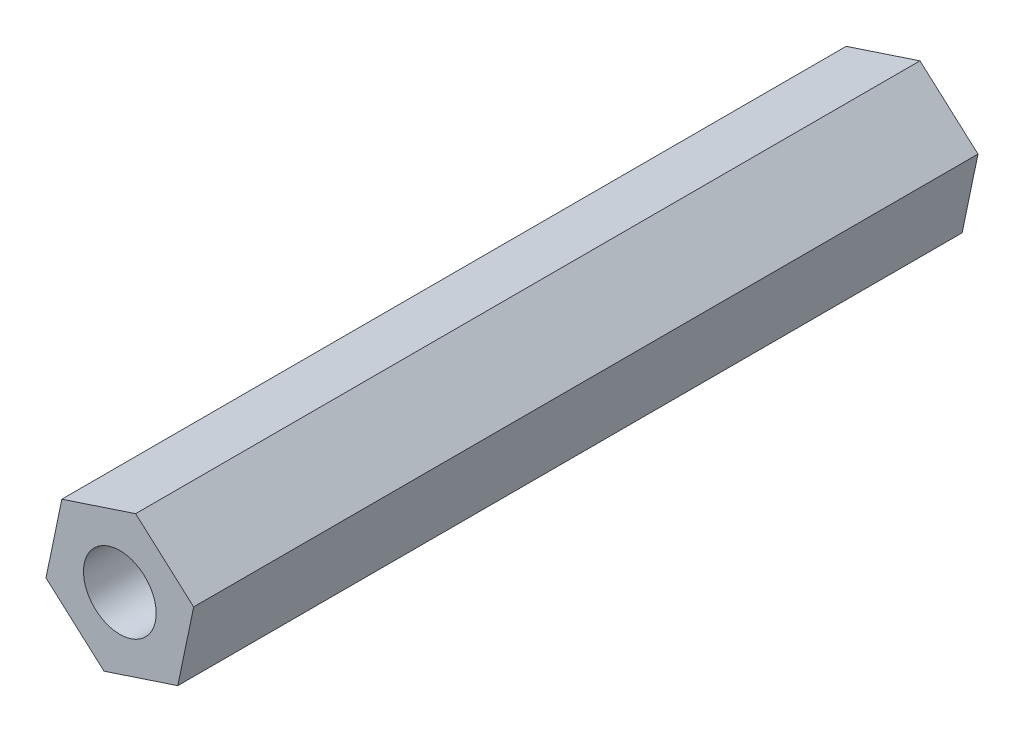
ISO-10303-21;
HEADER;
FILE_DESCRIPTION(('STEP AP214'),'2;1');
FILE_NAME('part.step','',(''),(''),'','','');
FILE_SCHEMA(('AUTOMOTIVE_DESIGN { 1 0 10303 214 1 1 1 1 }'));
ENDSEC;
DATA;
#1=APPLICATION_CONTEXT('core data for automotive mechanical design processes');
#2=APPLICATION_PROTOCOL_DEFINITION('international standard','automotive_design',2000,#1);
#3=PRODUCT_CONTEXT('',#1,'mechanical');
#4=PRODUCT('Part','Part','',(#3));
#5=PRODUCT_RELATED_PRODUCT_CATEGORY('part','',(#4));
#6=PRODUCT_DEFINITION_FORMATION('','',#4);
#7=PRODUCT_DEFINITION_CONTEXT('part definition',#1,'design');
#8=PRODUCT_DEFINITION('design','',#6,#7);
#9=PRODUCT_DEFINITION_SHAPE('','',#8);
#10=(LENGTH_UNIT() NAMED_UNIT(*) SI_UNIT(.MILLI.,.METRE.));
#11=(NAMED_UNIT(*) PLANE_ANGLE_UNIT() SI_UNIT($,.RADIAN.));
#12=(NAMED_UNIT(*) SI_UNIT($,.STERADIAN.) SOLID_ANGLE_UNIT());
#13=UNCERTAINTY_MEASURE_WITH_UNIT(LENGTH_MEASURE(1.E-05),#10,'distance_accuracy_value','');
#14=(GEOMETRIC_REPRESENTATION_CONTEXT(3) GLOBAL_UNCERTAINTY_ASSIGNED_CONTEXT((#13)) GLOBAL_UNIT_ASSIGNED_CONTEXT((#10,
#11,#12)) REPRESENTATION_CONTEXT('',''));
#15=CARTESIAN_POINT('',(0.,0.,0.));
#16=DIRECTION('',(0.,0.,1.));
#17=DIRECTION('',(1.,0.,0.));
#18=AXIS2_PLACEMENT_3D('',#15,#16,#17);
#19=CARTESIAN_POINT('',(2.71432127636962,-2.42125174417019,36.7));
#20=DIRECTION('',(-0.979102767295746,0.203366101093109,0.));
#21=DIRECTION('',(-0.203366101093109,-0.979102767295746,0.));
#22=AXIS2_PLACEMENT_3D('',#19,#20,#21);
#23=PLANE('',#22);
#24=DIRECTION('',(0.203366101093109,0.979102767295746,0.));
#25=VECTOR('',#24,1.);
#26=CARTESIAN_POINT('',(2.71432127636962,-2.42125174417019,0.));
#27=LINE('',#26,#25);
#28=CARTESIAN_POINT('',(2.71432127636962,-2.42125174417019,0.));
#29=VERTEX_POINT('',#28);
#30=CARTESIAN_POINT('',(3.45402615759358,1.1400453072836,0.));
#31=VERTEX_POINT('',#30);
#32=EDGE_CURVE('E116',#29,#31,#27,.T.);
#33=ORIENTED_EDGE('',*,*,#32,.T.);
#34=DIRECTION('',(0.,0.,-1.));
#35=VECTOR('',#34,1.);
#36=CARTESIAN_POINT('',(3.45402615759358,1.1400453072836,36.7));
#37=LINE('',#36,#35);
#38=CARTESIAN_POINT('',(3.45402615759358,1.1400453072836,36.7));
#39=VERTEX_POINT('',#38);
#40=EDGE_CURVE('E11',#39,#31,#37,.T.);
#41=ORIENTED_EDGE('',*,*,#40,.F.);
#42=DIRECTION('',(0.203366101093109,0.979102767295746,0.));
#43=VECTOR('',#42,1.);
#44=CARTESIAN_POINT('',(2.71432127636962,-2.42125174417019,36.7));
#45=LINE('',#44,#43);
#46=CARTESIAN_POINT('',(2.71432127636962,-2.42125174417019,36.7));
#47=VERTEX_POINT('',#46);
#48=EDGE_CURVE('E127',#47,#39,#45,.T.);
#49=ORIENTED_EDGE('',*,*,#48,.F.);
#50=DIRECTION('',(0.,0.,-1.));
#51=VECTOR('',#50,1.);
#52=CARTESIAN_POINT('',(2.71432127636962,-2.42125174417019,36.7));
#53=LINE('',#52,#51);
#54=EDGE_CURVE('E112',#47,#29,#53,.T.);
#55=ORIENTED_EDGE('',*,*,#54,.T.);
#56=EDGE_LOOP('',(#33,#41,#49,#55));
#57=FACE_BOUND('',#56,.T.);
#58=ADVANCED_FACE('F32',(#57),#23,.F.);
#59=CARTESIAN_POINT('',(3.45402615759358,1.1400453072836,36.7));
#60=DIRECTION('',(-0.6656715934631,-0.746244818847205,0.));
#61=DIRECTION('',(0.746244818847205,-0.6656715934631,0.));
#62=AXIS2_PLACEMENT_3D('',#59,#60,#61);
#63=PLANE('',#62);
#64=DIRECTION('',(-0.746244818847205,0.6656715934631,0.));
#65=VECTOR('',#64,1.);
#66=CARTESIAN_POINT('',(3.45402615759358,1.1400453072836,0.));
#67=LINE('',#66,#65);
#68=CARTESIAN_POINT('',(0.739704881223952,3.56129705145379,0.));
#69=VERTEX_POINT('',#68);
#70=EDGE_CURVE('E119',#31,#69,#67,.T.);
#71=ORIENTED_EDGE('',*,*,#70,.T.);
#72=DIRECTION('',(0.,0.,-1.));
#73=VECTOR('',#72,1.);
#74=CARTESIAN_POINT('',(0.739704881223952,3.56129705145379,36.7));
#75=LINE('',#74,#73);
#76=CARTESIAN_POINT('',(0.739704881223952,3.56129705145379,36.7));
#77=VERTEX_POINT('',#76);
#78=EDGE_CURVE('E40',#77,#69,#75,.T.);
#79=ORIENTED_EDGE('',*,*,#78,.F.);
#80=DIRECTION('',(-0.746244818847205,0.6656715934631,0.));
#81=VECTOR('',#80,1.);
#82=CARTESIAN_POINT('',(3.45402615759358,1.1400453072836,36.7));
#83=LINE('',#82,#81);
#84=EDGE_CURVE('E85',#39,#77,#83,.T.);
#85=ORIENTED_EDGE('',*,*,#84,.F.);
#86=ORIENTED_EDGE('',*,*,#40,.T.);
#87=EDGE_LOOP('',(#71,#79,#85,#86));
#88=FACE_BOUND('',#87,.T.);
#89=ADVANCED_FACE('F152',(#88),#63,.F.);
#90=CARTESIAN_POINT('',(0.739704881223952,3.56129705145379,36.7));
#91=DIRECTION('',(0.313431173832646,-0.949610919940314,0.));
#92=DIRECTION('',(0.949610919940314,0.313431173832646,0.));
#93=AXIS2_PLACEMENT_3D('',#90,#91,#92);
#94=PLANE('',#93);
#95=DIRECTION('',(-0.949610919940314,-0.313431173832646,0.));
#96=VECTOR('',#95,1.);
#97=CARTESIAN_POINT('',(0.739704881223952,3.56129705145379,0.));
#98=LINE('',#97,#96);
#99=CARTESIAN_POINT('',(-2.71432127636962,2.42125174417019,0.));
#100=VERTEX_POINT('',#99);
#101=EDGE_CURVE('E122',#69,#100,#98,.T.);
#102=ORIENTED_EDGE('',*,*,#101,.T.);
#103=DIRECTION('',(0.,0.,-1.));
#104=VECTOR('',#103,1.);
#105=CARTESIAN_POINT('',(-2.71432127636962,2.42125174417019,36.7));
#106=LINE('',#105,#104);
#107=CARTESIAN_POINT('',(-2.71432127636962,2.42125174417019,36.7));
#108=VERTEX_POINT('',#107);
#109=EDGE_CURVE('E107',#108,#100,#106,.T.);
#110=ORIENTED_EDGE('',*,*,#109,.F.);
#111=DIRECTION('',(-0.949610919940314,-0.313431173832646,0.));
#112=VECTOR('',#111,1.);
#113=CARTESIAN_POINT('',(0.739704881223952,3.56129705145379,36.7));
#114=LINE('',#113,#112);
#115=EDGE_CURVE('E98',#77,#108,#114,.T.);
#116=ORIENTED_EDGE('',*,*,#115,.F.);
#117=ORIENTED_EDGE('',*,*,#78,.T.);
#118=EDGE_LOOP('',(#102,#110,#116,#117));
#119=FACE_BOUND('',#118,.T.);
#120=ADVANCED_FACE('F133',(#119),#94,.F.);
#121=CARTESIAN_POINT('',(-2.71432127636962,2.42125174417019,36.7));
#122=DIRECTION('',(0.979102767295746,-0.203366101093109,0.));
#123=DIRECTION('',(0.203366101093109,0.979102767295746,0.));
#124=AXIS2_PLACEMENT_3D('',#121,#122,#123);
#125=PLANE('',#124);
#126=DIRECTION('',(-0.203366101093109,-0.979102767295746,0.));
#127=VECTOR('',#126,1.);
#128=CARTESIAN_POINT('',(-2.71432127636962,2.42125174417019,0.));
#129=LINE('',#128,#127);
#130=CARTESIAN_POINT('',(-3.45402615759358,-1.1400453072836,0.));
#131=VERTEX_POINT('',#130);
#132=EDGE_CURVE('E106',#100,#131,#129,.T.);
#133=ORIENTED_EDGE('',*,*,#132,.T.);
#134=DIRECTION('',(0.,0.,-1.));
#135=VECTOR('',#134,1.);
#136=CARTESIAN_POINT('',(-3.45402615759358,-1.1400453072836,36.7));
#137=LINE('',#136,#135);
#138=CARTESIAN_POINT('',(-3.45402615759358,-1.1400453072836,36.7));
#139=VERTEX_POINT('',#138);
#140=EDGE_CURVE('E103',#139,#131,#137,.T.);
#141=ORIENTED_EDGE('',*,*,#140,.F.);
#142=DIRECTION('',(-0.203366101093109,-0.979102767295746,0.));
#143=VECTOR('',#142,1.);
#144=CARTESIAN_POINT('',(-2.71432127636962,2.42125174417019,36.7));
#145=LINE('',#144,#143);
#146=EDGE_CURVE('E92',#108,#139,#145,.T.);
#147=ORIENTED_EDGE('',*,*,#146,.F.);
#148=ORIENTED_EDGE('',*,*,#109,.T.);
#149=EDGE_LOOP('',(#133,#141,#147,#148));
#150=FACE_BOUND('',#149,.T.);
#151=ADVANCED_FACE('F104',(#150),#125,.F.);
#152=CARTESIAN_POINT('',(-3.45402615759358,-1.1400453072836,36.7));
#153=DIRECTION('',(0.6656715934631,0.746244818847205,0.));
#154=DIRECTION('',(-0.746244818847205,0.6656715934631,0.));
#155=AXIS2_PLACEMENT_3D('',#152,#153,#154);
#156=PLANE('',#155);
#157=DIRECTION('',(0.746244818847205,-0.6656715934631,0.));
#158=VECTOR('',#157,1.);
#159=CARTESIAN_POINT('',(-3.45402615759358,-1.1400453072836,0.));
#160=LINE('',#159,#158);
#161=CARTESIAN_POINT('',(-0.739704881223952,-3.56129705145379,0.));
#162=VERTEX_POINT('',#161);
#163=EDGE_CURVE('E71',#131,#162,#160,.T.);
#164=ORIENTED_EDGE('',*,*,#163,.T.);
#165=DIRECTION('',(0.,0.,-1.));
#166=VECTOR('',#165,1.);
#167=CARTESIAN_POINT('',(-0.739704881223952,-3.56129705145379,36.7));
#168=LINE('',#167,#166);
#169=CARTESIAN_POINT('',(-0.739704881223952,-3.56129705145379,36.7));
#170=VERTEX_POINT('',#169);
#171=EDGE_CURVE('E108',#170,#162,#168,.T.);
#172=ORIENTED_EDGE('',*,*,#171,.F.);
#173=DIRECTION('',(0.746244818847205,-0.6656715934631,0.));
#174=VECTOR('',#173,1.);
#175=CARTESIAN_POINT('',(-3.45402615759358,-1.1400453072836,36.7));
#176=LINE('',#175,#174);
#177=EDGE_CURVE('E96',#139,#170,#176,.T.);
#178=ORIENTED_EDGE('',*,*,#177,.F.);
#179=ORIENTED_EDGE('',*,*,#140,.T.);
#180=EDGE_LOOP('',(#164,#172,#178,#179));
#181=FACE_BOUND('',#180,.T.);
#182=ADVANCED_FACE('F110',(#181),#156,.F.);
#183=CARTESIAN_POINT('',(-0.739704881223952,-3.56129705145379,36.7));
#184=DIRECTION('',(-0.313431173832646,0.949610919940314,0.));
#185=DIRECTION('',(-0.949610919940314,-0.313431173832646,0.));
#186=AXIS2_PLACEMENT_3D('',#183,#184,#185);
#187=PLANE('',#186);
#188=DIRECTION('',(0.949610919940314,0.313431173832646,0.));
#189=VECTOR('',#188,1.);
#190=CARTESIAN_POINT('',(-0.739704881223952,-3.56129705145379,0.));
#191=LINE('',#190,#189);
#192=EDGE_CURVE('E77',#162,#29,#191,.T.);
#193=ORIENTED_EDGE('',*,*,#192,.T.);
#194=ORIENTED_EDGE('',*,*,#54,.F.);
#195=DIRECTION('',(0.949610919940314,0.313431173832646,0.));
#196=VECTOR('',#195,1.);
#197=CARTESIAN_POINT('',(-0.739704881223952,-3.56129705145379,36.7));
#198=LINE('',#197,#196);
#199=EDGE_CURVE('E48',#170,#47,#198,.T.);
#200=ORIENTED_EDGE('',*,*,#199,.F.);
#201=ORIENTED_EDGE('',*,*,#171,.T.);
#202=EDGE_LOOP('',(#193,#194,#200,#201));
#203=FACE_BOUND('',#202,.T.);
#204=ADVANCED_FACE('F140',(#203),#187,.F.);
#205=CARTESIAN_POINT('',(0.,0.,36.7));
#206=DIRECTION('',(0.,0.,1.));
#207=DIRECTION('',(1.,0.,0.));
#208=AXIS2_PLACEMENT_3D('',#205,#206,#207);
#209=PLANE('',#208);
#210=CARTESIAN_POINT('',(0.,0.,36.7));
#211=DIRECTION('',(0.,0.,1.));
#212=DIRECTION('',(1.,0.,0.));
#213=AXIS2_PLACEMENT_3D('',#210,#211,#212);
#214=CIRCLE('',#213,1.7);
#215=CARTESIAN_POINT('',(1.7,0.,36.7));
#216=VERTEX_POINT('',#215);
#217=EDGE_CURVE('E207',#216,#216,#214,.T.);
#218=ORIENTED_EDGE('',*,*,#217,.F.);
#219=EDGE_LOOP('',(#218));
#220=FACE_BOUND('',#219,.T.);
#221=ORIENTED_EDGE('',*,*,#48,.T.);
#222=ORIENTED_EDGE('',*,*,#84,.T.);
#223=ORIENTED_EDGE('',*,*,#115,.T.);
#224=ORIENTED_EDGE('',*,*,#146,.T.);
#225=ORIENTED_EDGE('',*,*,#177,.T.);
#226=ORIENTED_EDGE('',*,*,#199,.T.);
#227=EDGE_LOOP('',(#221,#222,#223,#224,#225,#226));
#228=FACE_BOUND('',#227,.T.);
#229=ADVANCED_FACE('F94',(#220,#228),#209,.T.);
#230=CARTESIAN_POINT('',(0.,0.,0.));
#231=DIRECTION('',(0.,0.,1.));
#232=DIRECTION('',(1.,0.,0.));
#233=AXIS2_PLACEMENT_3D('',#230,#231,#232);
#234=PLANE('',#233);
#235=CARTESIAN_POINT('',(0.,0.,0.));
#236=DIRECTION('',(0.,0.,1.));
#237=DIRECTION('',(1.,0.,0.));
#238=AXIS2_PLACEMENT_3D('',#235,#236,#237);
#239=CIRCLE('',#238,1.7);
#240=CARTESIAN_POINT('',(1.7,0.,0.));
#241=VERTEX_POINT('',#240);
#242=EDGE_CURVE('E120',#241,#241,#239,.T.);
#243=ORIENTED_EDGE('',*,*,#242,.T.);
#244=EDGE_LOOP('',(#243));
#245=FACE_BOUND('',#244,.T.);
#246=ORIENTED_EDGE('',*,*,#32,.F.);
#247=ORIENTED_EDGE('',*,*,#192,.F.);
#248=ORIENTED_EDGE('',*,*,#163,.F.);
#249=ORIENTED_EDGE('',*,*,#132,.F.);
#250=ORIENTED_EDGE('',*,*,#101,.F.);
#251=ORIENTED_EDGE('',*,*,#70,.F.);
#252=EDGE_LOOP('',(#246,#247,#248,#249,#250,#251));
#253=FACE_BOUND('',#252,.T.);
#254=ADVANCED_FACE('F136',(#245,#253),#234,.F.);
#255=CARTESIAN_POINT('',(0.,0.,0.));
#256=DIRECTION('',(0.,0.,1.));
#257=DIRECTION('',(1.,0.,0.));
#258=AXIS2_PLACEMENT_3D('',#255,#256,#257);
#259=CYLINDRICAL_SURFACE('',#258,1.7);
#260=ORIENTED_EDGE('',*,*,#242,.F.);
#261=EDGE_LOOP('',(#260));
#262=FACE_BOUND('',#261,.T.);
#263=ORIENTED_EDGE('',*,*,#217,.T.);
#264=EDGE_LOOP('',(#263));
#265=FACE_BOUND('',#264,.T.);
#266=ADVANCED_FACE('F189',(#262,#265),#259,.F.);
#267=CLOSED_SHELL('',(#58,#89,#120,#151,#182,#204,#229,#254,#266));
#268=MANIFOLD_SOLID_BREP('B2',#267);
#269=ADVANCED_BREP_SHAPE_REPRESENTATION('',(#18,#268),#14);
#270=SHAPE_DEFINITION_REPRESENTATION(#9,#269);
ENDSEC;
END-ISO-10303-21;
